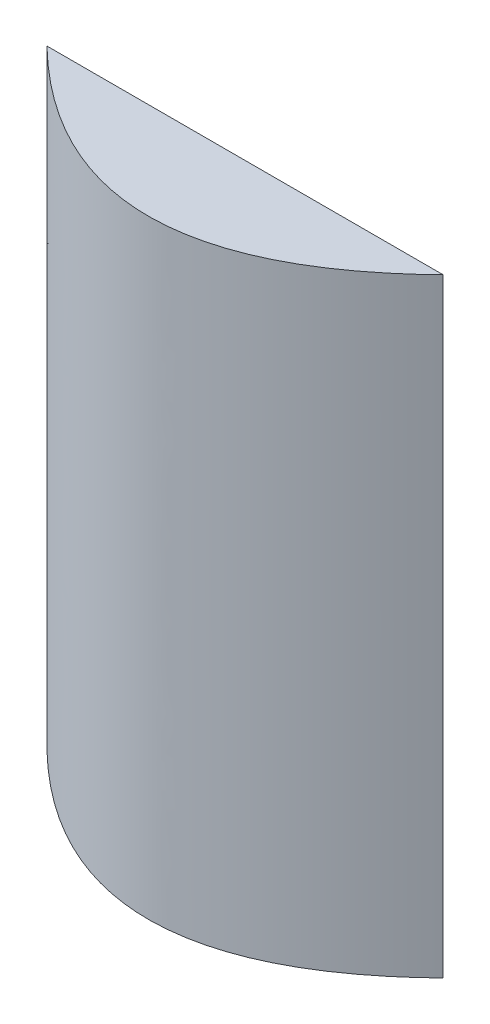
ISO-10303-21;
HEADER;
FILE_DESCRIPTION(('STEP AP214'),'2;1');
FILE_NAME('part.step','',(''),(''),'','','');
FILE_SCHEMA(('AUTOMOTIVE_DESIGN { 1 0 10303 214 1 1 1 1 }'));
ENDSEC;
DATA;
#1=APPLICATION_CONTEXT('core data for automotive mechanical design processes');
#2=APPLICATION_PROTOCOL_DEFINITION('international standard','automotive_design',2000,#1);
#3=PRODUCT_CONTEXT('',#1,'mechanical');
#4=PRODUCT('Part','Part','',(#3));
#5=PRODUCT_RELATED_PRODUCT_CATEGORY('part','',(#4));
#6=PRODUCT_DEFINITION_FORMATION('','',#4);
#7=PRODUCT_DEFINITION_CONTEXT('part definition',#1,'design');
#8=PRODUCT_DEFINITION('design','',#6,#7);
#9=PRODUCT_DEFINITION_SHAPE('','',#8);
#10=(LENGTH_UNIT() NAMED_UNIT(*) SI_UNIT(.MILLI.,.METRE.));
#11=(NAMED_UNIT(*) PLANE_ANGLE_UNIT() SI_UNIT($,.RADIAN.));
#12=(NAMED_UNIT(*) SI_UNIT($,.STERADIAN.) SOLID_ANGLE_UNIT());
#13=UNCERTAINTY_MEASURE_WITH_UNIT(LENGTH_MEASURE(1.E-05),#10,'distance_accuracy_value','');
#14=(GEOMETRIC_REPRESENTATION_CONTEXT(3) GLOBAL_UNCERTAINTY_ASSIGNED_CONTEXT((#13)) GLOBAL_UNIT_ASSIGNED_CONTEXT((#10,
#11,#12)) REPRESENTATION_CONTEXT('',''));
#15=CARTESIAN_POINT('',(0.,0.,0.));
#16=DIRECTION('',(0.,0.,1.));
#17=DIRECTION('',(1.,0.,0.));
#18=AXIS2_PLACEMENT_3D('',#15,#16,#17);
#19=CARTESIAN_POINT('',(-200.000000000337,300.,-6.70196537155832E-10));
#20=CARTESIAN_POINT('',(-5.91540705308091E-11,300.,400.000000000552));
#21=CARTESIAN_POINT('',(200.000000000219,300.,-4.34305369445553E-10));
#22=B_SPLINE_CURVE_WITH_KNOTS('',2,(#19,#20,#21),.UNSPECIFIED.,.F.,.F.,(3,3),(0.056028396232078,
0.943971603767659),.UNSPECIFIED.);
#23=DIRECTION('',(0.,-1.,0.));
#24=VECTOR('',#23,1.);
#25=SURFACE_OF_LINEAR_EXTRUSION('',#22,#24);
#26=CARTESIAN_POINT('',(-97.5704873417525,300.,152.399999999465));
#27=VERTEX_POINT('',#26);
#28=CARTESIAN_POINT('',(97.5704873417523,300.,152.399999999465));
#29=VERTEX_POINT('',#28);
#30=EDGE_CURVE('E40',#27,#29,#22,.T.);
#31=ORIENTED_EDGE('',*,*,#30,.F.);
#32=DIRECTION('',(0.,-1.,0.));
#33=VECTOR('',#32,1.);
#34=CARTESIAN_POINT('',(-97.5704873417535,300.,152.399999999465));
#35=LINE('',#34,#33);
#36=CARTESIAN_POINT('',(-97.5704873417525,0.,152.399999999465));
#37=VERTEX_POINT('',#36);
#38=EDGE_CURVE('E54',#27,#37,#35,.T.);
#39=ORIENTED_EDGE('',*,*,#38,.T.);
#40=CARTESIAN_POINT('',(-200.000000000337,0.,-6.70196537155832E-10));
#41=CARTESIAN_POINT('',(-5.91540705308091E-11,0.,400.000000000552));
#42=CARTESIAN_POINT('',(200.000000000219,0.,-4.34305369445553E-10));
#43=B_SPLINE_CURVE_WITH_KNOTS('',2,(#40,#41,#42),.UNSPECIFIED.,.F.,.F.,(3,3),(0.056028396232078,
0.943971603767659),.UNSPECIFIED.);
#44=CARTESIAN_POINT('',(97.5704873417523,0.,152.399999999466));
#45=VERTEX_POINT('',#44);
#46=EDGE_CURVE('E62',#37,#45,#43,.T.);
#47=ORIENTED_EDGE('',*,*,#46,.T.);
#48=DIRECTION('',(0.,-1.,0.));
#49=VECTOR('',#48,1.);
#50=CARTESIAN_POINT('',(97.5704873417531,300.,152.399999999465));
#51=LINE('',#50,#49);
#52=EDGE_CURVE('E46',#45,#29,#51,.F.);
#53=ORIENTED_EDGE('',*,*,#52,.T.);
#54=EDGE_LOOP('',(#31,#39,#47,#53));
#55=FACE_BOUND('',#54,.T.);
#56=ADVANCED_FACE('F32',(#55),#25,.F.);
#57=CARTESIAN_POINT('',(-5.9161009424713E-11,300.,200.));
#58=DIRECTION('',(0.,-1.,0.));
#59=DIRECTION('',(0.,0.,-1.));
#60=AXIS2_PLACEMENT_3D('',#57,#58,#59);
#61=PLANE('',#60);
#62=ORIENTED_EDGE('',*,*,#30,.T.);
#63=DIRECTION('',(1.,0.,0.));
#64=VECTOR('',#63,1.);
#65=CARTESIAN_POINT('',(-242.444770071978,300.,152.399999999465));
#66=LINE('',#65,#64);
#67=EDGE_CURVE('E57',#27,#29,#66,.T.);
#68=ORIENTED_EDGE('',*,*,#67,.F.);
#69=EDGE_LOOP('',(#62,#68));
#70=FACE_BOUND('',#69,.T.);
#71=ADVANCED_FACE('F66',(#70),#61,.F.);
#72=CARTESIAN_POINT('',(-5.9161009424713E-11,0.,200.));
#73=DIRECTION('',(0.,-1.,0.));
#74=DIRECTION('',(0.,0.,-1.));
#75=AXIS2_PLACEMENT_3D('',#72,#73,#74);
#76=PLANE('',#75);
#77=DIRECTION('',(-1.,0.,0.));
#78=VECTOR('',#77,1.);
#79=CARTESIAN_POINT('',(-5.9161009424713E-11,0.,152.399999999465));
#80=LINE('',#79,#78);
#81=EDGE_CURVE('E11',#45,#37,#80,.T.);
#82=ORIENTED_EDGE('',*,*,#81,.F.);
#83=ORIENTED_EDGE('',*,*,#46,.F.);
#84=EDGE_LOOP('',(#82,#83));
#85=FACE_BOUND('',#84,.T.);
#86=ADVANCED_FACE('F81',(#85),#76,.T.);
#87=CARTESIAN_POINT('',(-242.444770071978,-50.,152.399999999465));
#88=DIRECTION('',(0.,0.,1.));
#89=DIRECTION('',(1.,0.,0.));
#90=AXIS2_PLACEMENT_3D('',#87,#88,#89);
#91=PLANE('',#90);
#92=ORIENTED_EDGE('',*,*,#67,.T.);
#93=ORIENTED_EDGE('',*,*,#52,.F.);
#94=ORIENTED_EDGE('',*,*,#81,.T.);
#95=ORIENTED_EDGE('',*,*,#38,.F.);
#96=EDGE_LOOP('',(#92,#93,#94,#95));
#97=FACE_BOUND('',#96,.T.);
#98=ADVANCED_FACE('F56',(#97),#91,.F.);
#99=CLOSED_SHELL('',(#56,#71,#86,#98));
#100=MANIFOLD_SOLID_BREP('B2',#99);
#101=ADVANCED_BREP_SHAPE_REPRESENTATION('',(#18,#100),#14);
#102=SHAPE_DEFINITION_REPRESENTATION(#9,#101);
ENDSEC;
END-ISO-10303-21;
